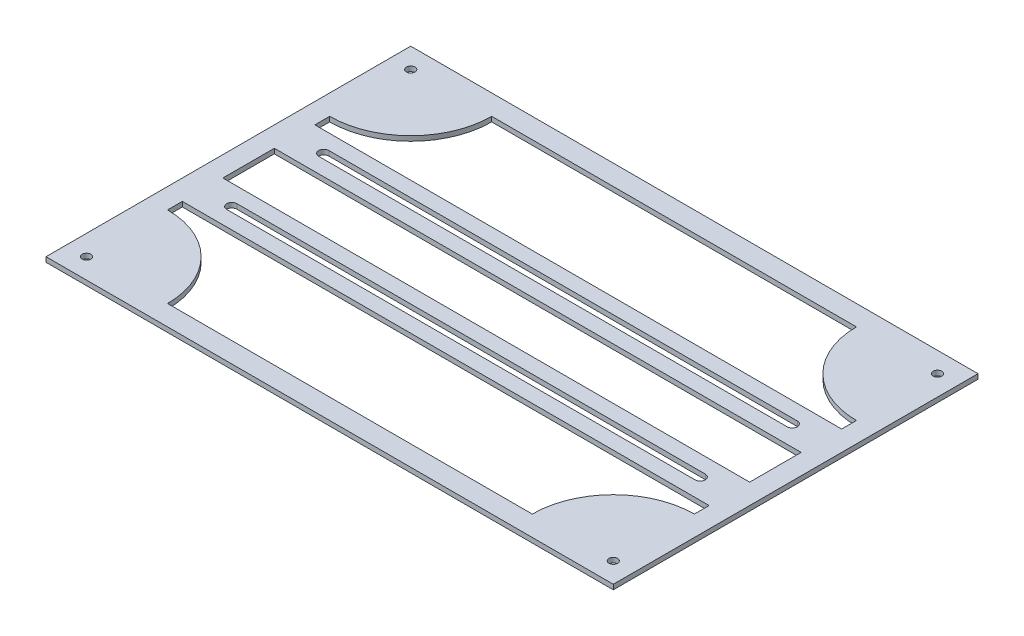
ISO-10303-21;
HEADER;
FILE_DESCRIPTION(('STEP AP214'),'2;1');
FILE_NAME('part.step','',(''),(''),'','','');
FILE_SCHEMA(('AUTOMOTIVE_DESIGN { 1 0 10303 214 1 1 1 1 }'));
ENDSEC;
DATA;
#1=APPLICATION_CONTEXT('core data for automotive mechanical design processes');
#2=APPLICATION_PROTOCOL_DEFINITION('international standard','automotive_design',2000,#1);
#3=PRODUCT_CONTEXT('',#1,'mechanical');
#4=PRODUCT('Part','Part','',(#3));
#5=PRODUCT_RELATED_PRODUCT_CATEGORY('part','',(#4));
#6=PRODUCT_DEFINITION_FORMATION('','',#4);
#7=PRODUCT_DEFINITION_CONTEXT('part definition',#1,'design');
#8=PRODUCT_DEFINITION('design','',#6,#7);
#9=PRODUCT_DEFINITION_SHAPE('','',#8);
#10=(LENGTH_UNIT() NAMED_UNIT(*) SI_UNIT(.MILLI.,.METRE.));
#11=(NAMED_UNIT(*) PLANE_ANGLE_UNIT() SI_UNIT($,.RADIAN.));
#12=(NAMED_UNIT(*) SI_UNIT($,.STERADIAN.) SOLID_ANGLE_UNIT());
#13=UNCERTAINTY_MEASURE_WITH_UNIT(LENGTH_MEASURE(1.E-05),#10,'distance_accuracy_value','');
#14=(GEOMETRIC_REPRESENTATION_CONTEXT(3) GLOBAL_UNCERTAINTY_ASSIGNED_CONTEXT((#13)) GLOBAL_UNIT_ASSIGNED_CONTEXT((#10,
#11,#12)) REPRESENTATION_CONTEXT('',''));
#15=CARTESIAN_POINT('',(0.,0.,0.));
#16=DIRECTION('',(0.,0.,1.));
#17=DIRECTION('',(1.,0.,0.));
#18=AXIS2_PLACEMENT_3D('',#15,#16,#17);
#19=CARTESIAN_POINT('',(-88.9,1.524,0.));
#20=DIRECTION('',(-1.,0.,0.));
#21=DIRECTION('',(0.,0.,1.));
#22=AXIS2_PLACEMENT_3D('',#19,#20,#21);
#23=PLANE('',#22);
#24=DIRECTION('',(0.,0.,-1.));
#25=VECTOR('',#24,1.);
#26=CARTESIAN_POINT('',(-88.9,0.,0.));
#27=LINE('',#26,#25);
#28=CARTESIAN_POINT('',(-88.9,0.,57.15));
#29=VERTEX_POINT('',#28);
#30=CARTESIAN_POINT('',(-88.9,0.,-57.15));
#31=VERTEX_POINT('',#30);
#32=EDGE_CURVE('E397',#29,#31,#27,.T.);
#33=ORIENTED_EDGE('',*,*,#32,.F.);
#34=DIRECTION('',(0.,-1.,0.));
#35=VECTOR('',#34,1.);
#36=CARTESIAN_POINT('',(-88.9,1.524,57.15));
#37=LINE('',#36,#35);
#38=CARTESIAN_POINT('',(-88.9,1.524,57.15));
#39=VERTEX_POINT('',#38);
#40=EDGE_CURVE('E11',#39,#29,#37,.T.);
#41=ORIENTED_EDGE('',*,*,#40,.F.);
#42=DIRECTION('',(0.,0.,-1.));
#43=VECTOR('',#42,1.);
#44=CARTESIAN_POINT('',(-88.9,1.524,0.));
#45=LINE('',#44,#43);
#46=CARTESIAN_POINT('',(-88.9,1.524,-57.15));
#47=VERTEX_POINT('',#46);
#48=EDGE_CURVE('E339',#39,#47,#45,.T.);
#49=ORIENTED_EDGE('',*,*,#48,.T.);
#50=DIRECTION('',(0.,-1.,0.));
#51=VECTOR('',#50,1.);
#52=CARTESIAN_POINT('',(-88.9,1.524,-57.15));
#53=LINE('',#52,#51);
#54=EDGE_CURVE('E408',#47,#31,#53,.T.);
#55=ORIENTED_EDGE('',*,*,#54,.T.);
#56=EDGE_LOOP('',(#33,#41,#49,#55));
#57=FACE_BOUND('',#56,.T.);
#58=ADVANCED_FACE('F37',(#57),#23,.T.);
#59=CARTESIAN_POINT('',(-164.548795430517,1.524,57.15));
#60=DIRECTION('',(0.,0.,1.));
#61=DIRECTION('',(1.,0.,0.));
#62=AXIS2_PLACEMENT_3D('',#59,#60,#61);
#63=PLANE('',#62);
#64=DIRECTION('',(-1.,0.,0.));
#65=VECTOR('',#64,1.);
#66=CARTESIAN_POINT('',(-164.548795430517,0.,57.15));
#67=LINE('',#66,#65);
#68=CARTESIAN_POINT('',(88.9,0.,57.15));
#69=VERTEX_POINT('',#68);
#70=EDGE_CURVE('E400',#69,#29,#67,.T.);
#71=ORIENTED_EDGE('',*,*,#70,.F.);
#72=DIRECTION('',(0.,-1.,0.));
#73=VECTOR('',#72,1.);
#74=CARTESIAN_POINT('',(88.9,1.524,57.15));
#75=LINE('',#74,#73);
#76=CARTESIAN_POINT('',(88.9,1.524,57.15));
#77=VERTEX_POINT('',#76);
#78=EDGE_CURVE('E46',#77,#69,#75,.T.);
#79=ORIENTED_EDGE('',*,*,#78,.F.);
#80=DIRECTION('',(-1.,0.,0.));
#81=VECTOR('',#80,1.);
#82=CARTESIAN_POINT('',(-164.548795430517,1.524,57.15));
#83=LINE('',#82,#81);
#84=EDGE_CURVE('E342',#77,#39,#83,.T.);
#85=ORIENTED_EDGE('',*,*,#84,.T.);
#86=ORIENTED_EDGE('',*,*,#40,.T.);
#87=EDGE_LOOP('',(#71,#79,#85,#86));
#88=FACE_BOUND('',#87,.T.);
#89=ADVANCED_FACE('F489',(#88),#63,.T.);
#90=CARTESIAN_POINT('',(88.9,1.524,0.));
#91=DIRECTION('',(-1.,0.,0.));
#92=DIRECTION('',(0.,0.,1.));
#93=AXIS2_PLACEMENT_3D('',#90,#91,#92);
#94=PLANE('',#93);
#95=DIRECTION('',(0.,0.,-1.));
#96=VECTOR('',#95,1.);
#97=CARTESIAN_POINT('',(88.9,0.,0.));
#98=LINE('',#97,#96);
#99=CARTESIAN_POINT('',(88.9,0.,-57.15));
#100=VERTEX_POINT('',#99);
#101=EDGE_CURVE('E403',#69,#100,#98,.T.);
#102=ORIENTED_EDGE('',*,*,#101,.T.);
#103=DIRECTION('',(0.,-1.,0.));
#104=VECTOR('',#103,1.);
#105=CARTESIAN_POINT('',(88.9,1.524,-57.15));
#106=LINE('',#105,#104);
#107=CARTESIAN_POINT('',(88.9,1.524,-57.15));
#108=VERTEX_POINT('',#107);
#109=EDGE_CURVE('E410',#108,#100,#106,.T.);
#110=ORIENTED_EDGE('',*,*,#109,.F.);
#111=DIRECTION('',(0.,0.,-1.));
#112=VECTOR('',#111,1.);
#113=CARTESIAN_POINT('',(88.9,1.524,0.));
#114=LINE('',#113,#112);
#115=EDGE_CURVE('E345',#77,#108,#114,.T.);
#116=ORIENTED_EDGE('',*,*,#115,.F.);
#117=ORIENTED_EDGE('',*,*,#78,.T.);
#118=EDGE_LOOP('',(#102,#110,#116,#117));
#119=FACE_BOUND('',#118,.T.);
#120=ADVANCED_FACE('F495',(#119),#94,.F.);
#121=CARTESIAN_POINT('',(82.55,1.524,0.));
#122=DIRECTION('',(-1.,0.,0.));
#123=DIRECTION('',(0.,0.,1.));
#124=AXIS2_PLACEMENT_3D('',#121,#122,#123);
#125=PLANE('',#124);
#126=DIRECTION('',(0.,0.,-1.));
#127=VECTOR('',#126,1.);
#128=CARTESIAN_POINT('',(82.55,0.,0.));
#129=LINE('',#128,#127);
#130=CARTESIAN_POINT('',(82.55,0.,8.06746468274631));
#131=VERTEX_POINT('',#130);
#132=CARTESIAN_POINT('',(82.55,0.,-8.06746468274633));
#133=VERTEX_POINT('',#132);
#134=EDGE_CURVE('E385',#131,#133,#129,.T.);
#135=ORIENTED_EDGE('',*,*,#134,.F.);
#136=DIRECTION('',(0.,-1.,0.));
#137=VECTOR('',#136,1.);
#138=CARTESIAN_POINT('',(82.55,1.524,8.06746468274631));
#139=LINE('',#138,#137);
#140=CARTESIAN_POINT('',(82.55,1.524,8.06746468274631));
#141=VERTEX_POINT('',#140);
#142=EDGE_CURVE('E411',#141,#131,#139,.T.);
#143=ORIENTED_EDGE('',*,*,#142,.F.);
#144=DIRECTION('',(0.,0.,-1.));
#145=VECTOR('',#144,1.);
#146=CARTESIAN_POINT('',(82.55,1.524,0.));
#147=LINE('',#146,#145);
#148=CARTESIAN_POINT('',(82.55,1.524,-8.06746468274633));
#149=VERTEX_POINT('',#148);
#150=EDGE_CURVE('E328',#141,#149,#147,.T.);
#151=ORIENTED_EDGE('',*,*,#150,.T.);
#152=DIRECTION('',(0.,-1.,0.));
#153=VECTOR('',#152,1.);
#154=CARTESIAN_POINT('',(82.55,1.524,-8.06746468274633));
#155=LINE('',#154,#153);
#156=EDGE_CURVE('E415',#149,#133,#155,.T.);
#157=ORIENTED_EDGE('',*,*,#156,.T.);
#158=EDGE_LOOP('',(#135,#143,#151,#157));
#159=FACE_BOUND('',#158,.T.);
#160=ADVANCED_FACE('F509',(#159),#125,.T.);
#161=CARTESIAN_POINT('',(-164.548795430517,1.524,8.06746468274631));
#162=DIRECTION('',(0.,0.,1.));
#163=DIRECTION('',(1.,0.,0.));
#164=AXIS2_PLACEMENT_3D('',#161,#162,#163);
#165=PLANE('',#164);
#166=DIRECTION('',(-1.,0.,0.));
#167=VECTOR('',#166,1.);
#168=CARTESIAN_POINT('',(-164.548795430517,0.,8.06746468274631));
#169=LINE('',#168,#167);
#170=CARTESIAN_POINT('',(-82.55,0.,8.06746468274631));
#171=VERTEX_POINT('',#170);
#172=EDGE_CURVE('E388',#131,#171,#169,.T.);
#173=ORIENTED_EDGE('',*,*,#172,.T.);
#174=DIRECTION('',(0.,-1.,0.));
#175=VECTOR('',#174,1.);
#176=CARTESIAN_POINT('',(-82.55,1.524,8.06746468274631));
#177=LINE('',#176,#175);
#178=CARTESIAN_POINT('',(-82.55,1.524,8.06746468274631));
#179=VERTEX_POINT('',#178);
#180=EDGE_CURVE('E420',#179,#171,#177,.T.);
#181=ORIENTED_EDGE('',*,*,#180,.F.);
#182=DIRECTION('',(-1.,0.,0.));
#183=VECTOR('',#182,1.);
#184=CARTESIAN_POINT('',(-164.548795430517,1.524,8.06746468274631));
#185=LINE('',#184,#183);
#186=EDGE_CURVE('E331',#141,#179,#185,.T.);
#187=ORIENTED_EDGE('',*,*,#186,.F.);
#188=ORIENTED_EDGE('',*,*,#142,.T.);
#189=EDGE_LOOP('',(#173,#181,#187,#188));
#190=FACE_BOUND('',#189,.T.);
#191=ADVANCED_FACE('F505',(#190),#165,.F.);
#192=CARTESIAN_POINT('',(-82.55,1.524,0.));
#193=DIRECTION('',(-1.,0.,0.));
#194=DIRECTION('',(0.,0.,1.));
#195=AXIS2_PLACEMENT_3D('',#192,#193,#194);
#196=PLANE('',#195);
#197=DIRECTION('',(0.,0.,-1.));
#198=VECTOR('',#197,1.);
#199=CARTESIAN_POINT('',(-82.55,0.,0.));
#200=LINE('',#199,#198);
#201=CARTESIAN_POINT('',(-82.55,0.,-8.06746468274633));
#202=VERTEX_POINT('',#201);
#203=EDGE_CURVE('E391',#171,#202,#200,.T.);
#204=ORIENTED_EDGE('',*,*,#203,.T.);
#205=DIRECTION('',(0.,-1.,0.));
#206=VECTOR('',#205,1.);
#207=CARTESIAN_POINT('',(-82.55,1.524,-8.06746468274633));
#208=LINE('',#207,#206);
#209=CARTESIAN_POINT('',(-82.55,1.524,-8.06746468274633));
#210=VERTEX_POINT('',#209);
#211=EDGE_CURVE('E417',#210,#202,#208,.T.);
#212=ORIENTED_EDGE('',*,*,#211,.F.);
#213=DIRECTION('',(0.,0.,-1.));
#214=VECTOR('',#213,1.);
#215=CARTESIAN_POINT('',(-82.55,1.524,0.));
#216=LINE('',#215,#214);
#217=EDGE_CURVE('E334',#179,#210,#216,.T.);
#218=ORIENTED_EDGE('',*,*,#217,.F.);
#219=ORIENTED_EDGE('',*,*,#180,.T.);
#220=EDGE_LOOP('',(#204,#212,#218,#219));
#221=FACE_BOUND('',#220,.T.);
#222=ADVANCED_FACE('F501',(#221),#196,.F.);
#223=CARTESIAN_POINT('',(82.55,1.524,50.8));
#224=DIRECTION('',(0.,-1.,0.));
#225=DIRECTION('',(0.,0.,-1.));
#226=AXIS2_PLACEMENT_3D('',#223,#224,#225);
#227=CYLINDRICAL_SURFACE('',#226,25.4);
#228=CARTESIAN_POINT('',(82.55,0.,50.8));
#229=DIRECTION('',(0.,1.,0.));
#230=DIRECTION('',(0.,0.,1.));
#231=AXIS2_PLACEMENT_3D('',#228,#229,#230);
#232=CIRCLE('',#231,25.4);
#233=CARTESIAN_POINT('',(57.15,0.,50.8));
#234=VERTEX_POINT('',#233);
#235=CARTESIAN_POINT('',(82.55,0.,25.3999999999999));
#236=VERTEX_POINT('',#235);
#237=EDGE_CURVE('E367',#234,#236,#232,.F.);
#238=ORIENTED_EDGE('',*,*,#237,.F.);
#239=DIRECTION('',(0.,-1.,0.));
#240=VECTOR('',#239,1.);
#241=CARTESIAN_POINT('',(57.15,1.524,50.8));
#242=LINE('',#241,#240);
#243=CARTESIAN_POINT('',(57.15,1.524,50.8));
#244=VERTEX_POINT('',#243);
#245=EDGE_CURVE('E418',#244,#234,#242,.T.);
#246=ORIENTED_EDGE('',*,*,#245,.F.);
#247=CARTESIAN_POINT('',(82.55,1.524,50.8));
#248=DIRECTION('',(0.,1.,0.));
#249=DIRECTION('',(0.,0.,1.));
#250=AXIS2_PLACEMENT_3D('',#247,#248,#249);
#251=CIRCLE('',#250,25.4);
#252=CARTESIAN_POINT('',(82.55,1.524,25.3999999999999));
#253=VERTEX_POINT('',#252);
#254=EDGE_CURVE('E311',#244,#253,#251,.F.);
#255=ORIENTED_EDGE('',*,*,#254,.T.);
#256=DIRECTION('',(0.,-1.,0.));
#257=VECTOR('',#256,1.);
#258=CARTESIAN_POINT('',(82.55,1.524,25.3999999999999));
#259=LINE('',#258,#257);
#260=EDGE_CURVE('E424',#253,#236,#259,.T.);
#261=ORIENTED_EDGE('',*,*,#260,.T.);
#262=EDGE_LOOP('',(#238,#246,#255,#261));
#263=FACE_BOUND('',#262,.T.);
#264=ADVANCED_FACE('F504',(#263),#227,.T.);
#265=CARTESIAN_POINT('',(-164.548795430517,1.524,50.8));
#266=DIRECTION('',(0.,0.,1.));
#267=DIRECTION('',(1.,0.,0.));
#268=AXIS2_PLACEMENT_3D('',#265,#266,#267);
#269=PLANE('',#268);
#270=DIRECTION('',(-1.,0.,0.));
#271=VECTOR('',#270,1.);
#272=CARTESIAN_POINT('',(-164.548795430517,0.,50.8));
#273=LINE('',#272,#271);
#274=CARTESIAN_POINT('',(-57.15,0.,50.8));
#275=VERTEX_POINT('',#274);
#276=EDGE_CURVE('E370',#234,#275,#273,.T.);
#277=ORIENTED_EDGE('',*,*,#276,.T.);
#278=DIRECTION('',(0.,-1.,0.));
#279=VECTOR('',#278,1.);
#280=CARTESIAN_POINT('',(-57.15,1.524,50.8));
#281=LINE('',#280,#279);
#282=CARTESIAN_POINT('',(-57.15,1.524,50.8));
#283=VERTEX_POINT('',#282);
#284=EDGE_CURVE('E433',#283,#275,#281,.T.);
#285=ORIENTED_EDGE('',*,*,#284,.F.);
#286=DIRECTION('',(-1.,0.,0.));
#287=VECTOR('',#286,1.);
#288=CARTESIAN_POINT('',(-164.548795430517,1.524,50.8));
#289=LINE('',#288,#287);
#290=EDGE_CURVE('E314',#244,#283,#289,.T.);
#291=ORIENTED_EDGE('',*,*,#290,.F.);
#292=ORIENTED_EDGE('',*,*,#245,.T.);
#293=EDGE_LOOP('',(#277,#285,#291,#292));
#294=FACE_BOUND('',#293,.T.);
#295=ADVANCED_FACE('F528',(#294),#269,.F.);
#296=CARTESIAN_POINT('',(-82.55,1.524,50.8));
#297=DIRECTION('',(0.,-1.,0.));
#298=DIRECTION('',(0.,0.,-1.));
#299=AXIS2_PLACEMENT_3D('',#296,#297,#298);
#300=CYLINDRICAL_SURFACE('',#299,25.4);
#301=CARTESIAN_POINT('',(-82.55,0.,50.8));
#302=DIRECTION('',(0.,1.,0.));
#303=DIRECTION('',(0.,0.,1.));
#304=AXIS2_PLACEMENT_3D('',#301,#302,#303);
#305=CIRCLE('',#304,25.4);
#306=CARTESIAN_POINT('',(-82.55,0.,25.3999999999999));
#307=VERTEX_POINT('',#306);
#308=EDGE_CURVE('E373',#275,#307,#305,.T.);
#309=ORIENTED_EDGE('',*,*,#308,.T.);
#310=DIRECTION('',(0.,-1.,0.));
#311=VECTOR('',#310,1.);
#312=CARTESIAN_POINT('',(-82.55,1.524,25.3999999999999));
#313=LINE('',#312,#311);
#314=CARTESIAN_POINT('',(-82.55,1.524,25.3999999999999));
#315=VERTEX_POINT('',#314);
#316=EDGE_CURVE('E430',#315,#307,#313,.T.);
#317=ORIENTED_EDGE('',*,*,#316,.F.);
#318=CARTESIAN_POINT('',(-82.55,1.524,50.8));
#319=DIRECTION('',(0.,1.,0.));
#320=DIRECTION('',(0.,0.,1.));
#321=AXIS2_PLACEMENT_3D('',#318,#319,#320);
#322=CIRCLE('',#321,25.4);
#323=EDGE_CURVE('E317',#283,#315,#322,.T.);
#324=ORIENTED_EDGE('',*,*,#323,.F.);
#325=ORIENTED_EDGE('',*,*,#284,.T.);
#326=EDGE_LOOP('',(#309,#317,#324,#325));
#327=FACE_BOUND('',#326,.T.);
#328=ADVANCED_FACE('F524',(#327),#300,.T.);
#329=CARTESIAN_POINT('',(-82.5500000000001,1.524,-2.39186672080716E-13));
#330=DIRECTION('',(-1.,0.,0.));
#331=DIRECTION('',(0.,0.,1.));
#332=AXIS2_PLACEMENT_3D('',#329,#330,#331);
#333=PLANE('',#332);
#334=DIRECTION('',(0.,0.,-1.));
#335=VECTOR('',#334,1.);
#336=CARTESIAN_POINT('',(-82.5500000000001,0.,-2.39186672080716E-13));
#337=LINE('',#336,#335);
#338=CARTESIAN_POINT('',(-82.55,0.,20.7674646827463));
#339=VERTEX_POINT('',#338);
#340=EDGE_CURVE('E376',#307,#339,#337,.T.);
#341=ORIENTED_EDGE('',*,*,#340,.T.);
#342=DIRECTION('',(0.,-1.,0.));
#343=VECTOR('',#342,1.);
#344=CARTESIAN_POINT('',(-82.55,1.524,20.7674646827463));
#345=LINE('',#344,#343);
#346=CARTESIAN_POINT('',(-82.55,1.524,20.7674646827463));
#347=VERTEX_POINT('',#346);
#348=EDGE_CURVE('E428',#347,#339,#345,.T.);
#349=ORIENTED_EDGE('',*,*,#348,.F.);
#350=DIRECTION('',(0.,0.,-1.));
#351=VECTOR('',#350,1.);
#352=CARTESIAN_POINT('',(-82.5500000000001,1.524,-2.39186672080716E-13));
#353=LINE('',#352,#351);
#354=EDGE_CURVE('E320',#315,#347,#353,.T.);
#355=ORIENTED_EDGE('',*,*,#354,.F.);
#356=ORIENTED_EDGE('',*,*,#316,.T.);
#357=EDGE_LOOP('',(#341,#349,#355,#356));
#358=FACE_BOUND('',#357,.T.);
#359=ADVANCED_FACE('F520',(#358),#333,.F.);
#360=CARTESIAN_POINT('',(-164.548795430517,1.524,20.7674646827463));
#361=DIRECTION('',(0.,0.,1.));
#362=DIRECTION('',(1.,0.,0.));
#363=AXIS2_PLACEMENT_3D('',#360,#361,#362);
#364=PLANE('',#363);
#365=DIRECTION('',(-1.,0.,0.));
#366=VECTOR('',#365,1.);
#367=CARTESIAN_POINT('',(-164.548795430517,0.,20.7674646827463));
#368=LINE('',#367,#366);
#369=CARTESIAN_POINT('',(82.55,0.,20.7674646827463));
#370=VERTEX_POINT('',#369);
#371=EDGE_CURVE('E379',#370,#339,#368,.T.);
#372=ORIENTED_EDGE('',*,*,#371,.F.);
#373=DIRECTION('',(0.,-1.,0.));
#374=VECTOR('',#373,1.);
#375=CARTESIAN_POINT('',(82.55,1.524,20.7674646827463));
#376=LINE('',#375,#374);
#377=CARTESIAN_POINT('',(82.55,1.524,20.7674646827463));
#378=VERTEX_POINT('',#377);
#379=EDGE_CURVE('E426',#378,#370,#376,.T.);
#380=ORIENTED_EDGE('',*,*,#379,.F.);
#381=DIRECTION('',(-1.,0.,0.));
#382=VECTOR('',#381,1.);
#383=CARTESIAN_POINT('',(-164.548795430517,1.524,20.7674646827463));
#384=LINE('',#383,#382);
#385=EDGE_CURVE('E322',#378,#347,#384,.T.);
#386=ORIENTED_EDGE('',*,*,#385,.T.);
#387=ORIENTED_EDGE('',*,*,#348,.T.);
#388=EDGE_LOOP('',(#372,#380,#386,#387));
#389=FACE_BOUND('',#388,.T.);
#390=ADVANCED_FACE('F517',(#389),#364,.T.);
#391=CARTESIAN_POINT('',(-82.55,1.524,-50.8));
#392=DIRECTION('',(0.,-1.,0.));
#393=DIRECTION('',(0.,0.,-1.));
#394=AXIS2_PLACEMENT_3D('',#391,#392,#393);
#395=CYLINDRICAL_SURFACE('',#394,25.4);
#396=CARTESIAN_POINT('',(-82.55,0.,-50.8));
#397=DIRECTION('',(0.,1.,0.));
#398=DIRECTION('',(0.,0.,1.));
#399=AXIS2_PLACEMENT_3D('',#396,#397,#398);
#400=CIRCLE('',#399,25.4);
#401=CARTESIAN_POINT('',(-57.15,0.,-50.8));
#402=VERTEX_POINT('',#401);
#403=CARTESIAN_POINT('',(-82.55,0.,-25.4));
#404=VERTEX_POINT('',#403);
#405=EDGE_CURVE('E288',#402,#404,#400,.F.);
#406=ORIENTED_EDGE('',*,*,#405,.F.);
#407=DIRECTION('',(0.,-1.,0.));
#408=VECTOR('',#407,1.);
#409=CARTESIAN_POINT('',(-57.15,1.524,-50.8));
#410=LINE('',#409,#408);
#411=CARTESIAN_POINT('',(-57.15,1.524,-50.8));
#412=VERTEX_POINT('',#411);
#413=EDGE_CURVE('E41',#412,#402,#410,.T.);
#414=ORIENTED_EDGE('',*,*,#413,.F.);
#415=CARTESIAN_POINT('',(-82.55,1.524,-50.8));
#416=DIRECTION('',(0.,1.,0.));
#417=DIRECTION('',(0.,0.,1.));
#418=AXIS2_PLACEMENT_3D('',#415,#416,#417);
#419=CIRCLE('',#418,25.4);
#420=CARTESIAN_POINT('',(-82.55,1.524,-25.4));
#421=VERTEX_POINT('',#420);
#422=EDGE_CURVE('E295',#412,#421,#419,.F.);
#423=ORIENTED_EDGE('',*,*,#422,.T.);
#424=DIRECTION('',(0.,-1.,0.));
#425=VECTOR('',#424,1.);
#426=CARTESIAN_POINT('',(-82.55,1.524,-25.4));
#427=LINE('',#426,#425);
#428=EDGE_CURVE('E350',#421,#404,#427,.T.);
#429=ORIENTED_EDGE('',*,*,#428,.T.);
#430=EDGE_LOOP('',(#406,#414,#423,#429));
#431=FACE_BOUND('',#430,.T.);
#432=ADVANCED_FACE('F39',(#431),#395,.T.);
#433=CARTESIAN_POINT('',(-164.548795430517,1.524,-50.8));
#434=DIRECTION('',(0.,0.,1.));
#435=DIRECTION('',(1.,0.,0.));
#436=AXIS2_PLACEMENT_3D('',#433,#434,#435);
#437=PLANE('',#436);
#438=DIRECTION('',(-1.,0.,0.));
#439=VECTOR('',#438,1.);
#440=CARTESIAN_POINT('',(-164.548795430517,0.,-50.8));
#441=LINE('',#440,#439);
#442=CARTESIAN_POINT('',(57.15,0.,-50.8));
#443=VERTEX_POINT('',#442);
#444=EDGE_CURVE('E353',#443,#402,#441,.T.);
#445=ORIENTED_EDGE('',*,*,#444,.F.);
#446=DIRECTION('',(0.,-1.,0.));
#447=VECTOR('',#446,1.);
#448=CARTESIAN_POINT('',(57.15,1.524,-50.8));
#449=LINE('',#448,#447);
#450=CARTESIAN_POINT('',(57.15,1.524,-50.8));
#451=VERTEX_POINT('',#450);
#452=EDGE_CURVE('E444',#451,#443,#449,.T.);
#453=ORIENTED_EDGE('',*,*,#452,.F.);
#454=DIRECTION('',(-1.,0.,0.));
#455=VECTOR('',#454,1.);
#456=CARTESIAN_POINT('',(-164.548795430517,1.524,-50.8));
#457=LINE('',#456,#455);
#458=EDGE_CURVE('E298',#451,#412,#457,.T.);
#459=ORIENTED_EDGE('',*,*,#458,.T.);
#460=ORIENTED_EDGE('',*,*,#413,.T.);
#461=EDGE_LOOP('',(#445,#453,#459,#460));
#462=FACE_BOUND('',#461,.T.);
#463=ADVANCED_FACE('F451',(#462),#437,.T.);
#464=CARTESIAN_POINT('',(82.55,1.524,-50.8));
#465=DIRECTION('',(0.,-1.,0.));
#466=DIRECTION('',(0.,0.,-1.));
#467=AXIS2_PLACEMENT_3D('',#464,#465,#466);
#468=CYLINDRICAL_SURFACE('',#467,25.4);
#469=CARTESIAN_POINT('',(82.55,0.,-50.8));
#470=DIRECTION('',(0.,1.,0.));
#471=DIRECTION('',(0.,0.,1.));
#472=AXIS2_PLACEMENT_3D('',#469,#470,#471);
#473=CIRCLE('',#472,25.4);
#474=CARTESIAN_POINT('',(82.55,0.,-25.4));
#475=VERTEX_POINT('',#474);
#476=EDGE_CURVE('E356',#443,#475,#473,.T.);
#477=ORIENTED_EDGE('',*,*,#476,.T.);
#478=DIRECTION('',(0.,-1.,0.));
#479=VECTOR('',#478,1.);
#480=CARTESIAN_POINT('',(82.55,1.524,-25.4));
#481=LINE('',#480,#479);
#482=CARTESIAN_POINT('',(82.55,1.524,-25.4));
#483=VERTEX_POINT('',#482);
#484=EDGE_CURVE('E443',#483,#475,#481,.T.);
#485=ORIENTED_EDGE('',*,*,#484,.F.);
#486=CARTESIAN_POINT('',(82.55,1.524,-50.8));
#487=DIRECTION('',(0.,1.,0.));
#488=DIRECTION('',(0.,0.,1.));
#489=AXIS2_PLACEMENT_3D('',#486,#487,#488);
#490=CIRCLE('',#489,25.4);
#491=EDGE_CURVE('E302',#451,#483,#490,.T.);
#492=ORIENTED_EDGE('',*,*,#491,.F.);
#493=ORIENTED_EDGE('',*,*,#452,.T.);
#494=EDGE_LOOP('',(#477,#485,#492,#493));
#495=FACE_BOUND('',#494,.T.);
#496=ADVANCED_FACE('F462',(#495),#468,.T.);
#497=CARTESIAN_POINT('',(82.55,1.524,-7.33780368654733E-13));
#498=DIRECTION('',(-1.,0.,0.));
#499=DIRECTION('',(0.,0.,1.));
#500=AXIS2_PLACEMENT_3D('',#497,#498,#499);
#501=PLANE('',#500);
#502=DIRECTION('',(0.,0.,-1.));
#503=VECTOR('',#502,1.);
#504=CARTESIAN_POINT('',(82.55,0.,-7.33780368654733E-13));
#505=LINE('',#504,#503);
#506=CARTESIAN_POINT('',(82.55,0.,-20.7674646827463));
#507=VERTEX_POINT('',#506);
#508=EDGE_CURVE('E359',#507,#475,#505,.T.);
#509=ORIENTED_EDGE('',*,*,#508,.F.);
#510=DIRECTION('',(0.,-1.,0.));
#511=VECTOR('',#510,1.);
#512=CARTESIAN_POINT('',(82.55,1.524,-20.7674646827463));
#513=LINE('',#512,#511);
#514=CARTESIAN_POINT('',(82.55,1.524,-20.7674646827463));
#515=VERTEX_POINT('',#514);
#516=EDGE_CURVE('E441',#515,#507,#513,.T.);
#517=ORIENTED_EDGE('',*,*,#516,.F.);
#518=DIRECTION('',(0.,0.,-1.));
#519=VECTOR('',#518,1.);
#520=CARTESIAN_POINT('',(82.55,1.524,-7.33780368654733E-13));
#521=LINE('',#520,#519);
#522=EDGE_CURVE('E304',#515,#483,#521,.T.);
#523=ORIENTED_EDGE('',*,*,#522,.T.);
#524=ORIENTED_EDGE('',*,*,#484,.T.);
#525=EDGE_LOOP('',(#509,#517,#523,#524));
#526=FACE_BOUND('',#525,.T.);
#527=ADVANCED_FACE('F465',(#526),#501,.T.);
#528=CARTESIAN_POINT('',(-164.548795430517,1.524,-20.7674646827463));
#529=DIRECTION('',(0.,0.,1.));
#530=DIRECTION('',(1.,0.,0.));
#531=AXIS2_PLACEMENT_3D('',#528,#529,#530);
#532=PLANE('',#531);
#533=DIRECTION('',(-1.,0.,0.));
#534=VECTOR('',#533,1.);
#535=CARTESIAN_POINT('',(-164.548795430517,0.,-20.7674646827463));
#536=LINE('',#535,#534);
#537=CARTESIAN_POINT('',(-82.55,0.,-20.7674646827463));
#538=VERTEX_POINT('',#537);
#539=EDGE_CURVE('E362',#507,#538,#536,.T.);
#540=ORIENTED_EDGE('',*,*,#539,.T.);
#541=DIRECTION('',(0.,-1.,0.));
#542=VECTOR('',#541,1.);
#543=CARTESIAN_POINT('',(-82.55,1.524,-20.7674646827463));
#544=LINE('',#543,#542);
#545=CARTESIAN_POINT('',(-82.55,1.524,-20.7674646827463));
#546=VERTEX_POINT('',#545);
#547=EDGE_CURVE('E438',#546,#538,#544,.T.);
#548=ORIENTED_EDGE('',*,*,#547,.F.);
#549=DIRECTION('',(-1.,0.,0.));
#550=VECTOR('',#549,1.);
#551=CARTESIAN_POINT('',(-164.548795430517,1.524,-20.7674646827463));
#552=LINE('',#551,#550);
#553=EDGE_CURVE('E307',#515,#546,#552,.T.);
#554=ORIENTED_EDGE('',*,*,#553,.F.);
#555=ORIENTED_EDGE('',*,*,#516,.T.);
#556=EDGE_LOOP('',(#540,#548,#554,#555));
#557=FACE_BOUND('',#556,.T.);
#558=ADVANCED_FACE('F475',(#557),#532,.F.);
#559=CARTESIAN_POINT('',(-164.548795430517,1.524,-8.06746468274633));
#560=DIRECTION('',(0.,0.,1.));
#561=DIRECTION('',(1.,0.,0.));
#562=AXIS2_PLACEMENT_3D('',#559,#560,#561);
#563=PLANE('',#562);
#564=DIRECTION('',(-1.,0.,0.));
#565=VECTOR('',#564,1.);
#566=CARTESIAN_POINT('',(-164.548795430517,0.,-8.06746468274633));
#567=LINE('',#566,#565);
#568=EDGE_CURVE('E394',#133,#202,#567,.T.);
#569=ORIENTED_EDGE('',*,*,#568,.F.);
#570=ORIENTED_EDGE('',*,*,#156,.F.);
#571=DIRECTION('',(-1.,0.,0.));
#572=VECTOR('',#571,1.);
#573=CARTESIAN_POINT('',(-164.548795430517,1.524,-8.06746468274633));
#574=LINE('',#573,#572);
#575=EDGE_CURVE('E336',#149,#210,#574,.T.);
#576=ORIENTED_EDGE('',*,*,#575,.T.);
#577=ORIENTED_EDGE('',*,*,#211,.T.);
#578=EDGE_LOOP('',(#569,#570,#576,#577));
#579=FACE_BOUND('',#578,.T.);
#580=ADVANCED_FACE('F477',(#579),#563,.T.);
#581=CARTESIAN_POINT('',(82.5500000000001,1.524,7.46698209794281E-13));
#582=DIRECTION('',(-1.,0.,0.));
#583=DIRECTION('',(0.,0.,1.));
#584=AXIS2_PLACEMENT_3D('',#581,#582,#583);
#585=PLANE('',#584);
#586=DIRECTION('',(0.,0.,-1.));
#587=VECTOR('',#586,1.);
#588=CARTESIAN_POINT('',(82.5500000000001,0.,7.46698209794281E-13));
#589=LINE('',#588,#587);
#590=EDGE_CURVE('E382',#236,#370,#589,.T.);
#591=ORIENTED_EDGE('',*,*,#590,.F.);
#592=ORIENTED_EDGE('',*,*,#260,.F.);
#593=DIRECTION('',(0.,0.,-1.));
#594=VECTOR('',#593,1.);
#595=CARTESIAN_POINT('',(82.5500000000001,1.524,7.46698209794281E-13));
#596=LINE('',#595,#594);
#597=EDGE_CURVE('E325',#253,#378,#596,.T.);
#598=ORIENTED_EDGE('',*,*,#597,.T.);
#599=ORIENTED_EDGE('',*,*,#379,.T.);
#600=EDGE_LOOP('',(#591,#592,#598,#599));
#601=FACE_BOUND('',#600,.T.);
#602=ADVANCED_FACE('F483',(#601),#585,.T.);
#603=CARTESIAN_POINT('',(-82.5500000000001,1.524,2.52104513220263E-13));
#604=DIRECTION('',(-1.,0.,0.));
#605=DIRECTION('',(0.,0.,1.));
#606=AXIS2_PLACEMENT_3D('',#603,#604,#605);
#607=PLANE('',#606);
#608=DIRECTION('',(0.,0.,-1.));
#609=VECTOR('',#608,1.);
#610=CARTESIAN_POINT('',(-82.5500000000001,0.,2.52104513220263E-13));
#611=LINE('',#610,#609);
#612=EDGE_CURVE('E364',#538,#404,#611,.T.);
#613=ORIENTED_EDGE('',*,*,#612,.T.);
#614=ORIENTED_EDGE('',*,*,#428,.F.);
#615=DIRECTION('',(0.,0.,-1.));
#616=VECTOR('',#615,1.);
#617=CARTESIAN_POINT('',(-82.5500000000001,1.524,2.52104513220263E-13));
#618=LINE('',#617,#616);
#619=EDGE_CURVE('E309',#546,#421,#618,.T.);
#620=ORIENTED_EDGE('',*,*,#619,.F.);
#621=ORIENTED_EDGE('',*,*,#547,.T.);
#622=EDGE_LOOP('',(#613,#614,#620,#621));
#623=FACE_BOUND('',#622,.T.);
#624=ADVANCED_FACE('F473',(#623),#607,.F.);
#625=CARTESIAN_POINT('',(-164.548795430517,1.524,-57.15));
#626=DIRECTION('',(0.,0.,1.));
#627=DIRECTION('',(1.,0.,0.));
#628=AXIS2_PLACEMENT_3D('',#625,#626,#627);
#629=PLANE('',#628);
#630=DIRECTION('',(-1.,0.,0.));
#631=VECTOR('',#630,1.);
#632=CARTESIAN_POINT('',(-164.548795430517,0.,-57.15));
#633=LINE('',#632,#631);
#634=EDGE_CURVE('E299',#100,#31,#633,.T.);
#635=ORIENTED_EDGE('',*,*,#634,.T.);
#636=ORIENTED_EDGE('',*,*,#54,.F.);
#637=DIRECTION('',(-1.,0.,0.));
#638=VECTOR('',#637,1.);
#639=CARTESIAN_POINT('',(-164.548795430517,1.524,-57.15));
#640=LINE('',#639,#638);
#641=EDGE_CURVE('E348',#108,#47,#640,.T.);
#642=ORIENTED_EDGE('',*,*,#641,.F.);
#643=ORIENTED_EDGE('',*,*,#109,.T.);
#644=EDGE_LOOP('',(#635,#636,#642,#643));
#645=FACE_BOUND('',#644,.T.);
#646=ADVANCED_FACE('F536',(#645),#629,.F.);
#647=CARTESIAN_POINT('',(-164.548795430517,1.524,0.));
#648=DIRECTION('',(0.,1.,0.));
#649=DIRECTION('',(0.,0.,1.));
#650=AXIS2_PLACEMENT_3D('',#647,#648,#649);
#651=PLANE('',#650);
#652=CARTESIAN_POINT('',(-82.55,1.524,-50.8));
#653=DIRECTION('',(0.,1.,0.));
#654=DIRECTION('',(0.,0.,1.));
#655=AXIS2_PLACEMENT_3D('',#652,#653,#654);
#656=CIRCLE('',#655,1.35254999999999);
#657=CARTESIAN_POINT('',(-82.55,1.524,-49.44745));
#658=VERTEX_POINT('',#657);
#659=EDGE_CURVE('E596',#658,#658,#656,.T.);
#660=ORIENTED_EDGE('',*,*,#659,.F.);
#661=EDGE_LOOP('',(#660));
#662=FACE_BOUND('',#661,.T.);
#663=CARTESIAN_POINT('',(-82.55,1.524,50.8));
#664=DIRECTION('',(0.,1.,0.));
#665=DIRECTION('',(0.,0.,1.));
#666=AXIS2_PLACEMENT_3D('',#663,#664,#665);
#667=CIRCLE('',#666,1.35254999999999);
#668=CARTESIAN_POINT('',(-82.55,1.524,52.15255));
#669=VERTEX_POINT('',#668);
#670=EDGE_CURVE('E592',#669,#669,#667,.T.);
#671=ORIENTED_EDGE('',*,*,#670,.F.);
#672=EDGE_LOOP('',(#671));
#673=FACE_BOUND('',#672,.T.);
#674=CARTESIAN_POINT('',(82.55,1.524,50.8));
#675=DIRECTION('',(0.,1.,0.));
#676=DIRECTION('',(0.,0.,1.));
#677=AXIS2_PLACEMENT_3D('',#674,#675,#676);
#678=CIRCLE('',#677,1.35254999999999);
#679=CARTESIAN_POINT('',(82.55,1.524,52.15255));
#680=VERTEX_POINT('',#679);
#681=EDGE_CURVE('E586',#680,#680,#678,.T.);
#682=ORIENTED_EDGE('',*,*,#681,.F.);
#683=EDGE_LOOP('',(#682));
#684=FACE_BOUND('',#683,.T.);
#685=CARTESIAN_POINT('',(82.55,1.524,-50.8));
#686=DIRECTION('',(0.,1.,0.));
#687=DIRECTION('',(0.,0.,1.));
#688=AXIS2_PLACEMENT_3D('',#685,#686,#687);
#689=CIRCLE('',#688,1.35254999999999);
#690=CARTESIAN_POINT('',(82.55,1.524,-49.44745));
#691=VERTEX_POINT('',#690);
#692=EDGE_CURVE('E247',#691,#691,#689,.T.);
#693=ORIENTED_EDGE('',*,*,#692,.F.);
#694=EDGE_LOOP('',(#693));
#695=FACE_BOUND('',#694,.T.);
#696=CARTESIAN_POINT('',(-73.406,1.524,14.4174646827463));
#697=DIRECTION('',(0.,1.,0.));
#698=DIRECTION('',(0.,0.,-1.));
#699=AXIS2_PLACEMENT_3D('',#696,#697,#698);
#700=CIRCLE('',#699,1.5875);
#701=CARTESIAN_POINT('',(-73.406,1.524,12.8299646827463));
#702=VERTEX_POINT('',#701);
#703=CARTESIAN_POINT('',(-73.406,1.524,16.0049646827463));
#704=VERTEX_POINT('',#703);
#705=EDGE_CURVE('E54',#702,#704,#700,.T.);
#706=ORIENTED_EDGE('',*,*,#705,.F.);
#707=DIRECTION('',(-1.,0.,0.));
#708=VECTOR('',#707,1.);
#709=CARTESIAN_POINT('',(-73.406,1.524,12.8299646827463));
#710=LINE('',#709,#708);
#711=CARTESIAN_POINT('',(73.406,1.524,12.8299646827463));
#712=VERTEX_POINT('',#711);
#713=EDGE_CURVE('E241',#712,#702,#710,.T.);
#714=ORIENTED_EDGE('',*,*,#713,.F.);
#715=CARTESIAN_POINT('',(73.406,1.524,14.4174646827463));
#716=DIRECTION('',(0.,1.,0.));
#717=DIRECTION('',(0.,0.,-1.));
#718=AXIS2_PLACEMENT_3D('',#715,#716,#717);
#719=CIRCLE('',#718,1.5875);
#720=CARTESIAN_POINT('',(73.406,1.524,16.0049646827463));
#721=VERTEX_POINT('',#720);
#722=EDGE_CURVE('E244',#721,#712,#719,.T.);
#723=ORIENTED_EDGE('',*,*,#722,.F.);
#724=DIRECTION('',(1.,0.,0.));
#725=VECTOR('',#724,1.);
#726=CARTESIAN_POINT('',(-73.406,1.524,16.0049646827463));
#727=LINE('',#726,#725);
#728=EDGE_CURVE('E253',#704,#721,#727,.T.);
#729=ORIENTED_EDGE('',*,*,#728,.F.);
#730=EDGE_LOOP('',(#706,#714,#723,#729));
#731=FACE_BOUND('',#730,.T.);
#732=CARTESIAN_POINT('',(-73.406,1.524,-14.4174646827463));
#733=DIRECTION('',(0.,1.,0.));
#734=DIRECTION('',(0.,0.,1.));
#735=AXIS2_PLACEMENT_3D('',#732,#733,#734);
#736=CIRCLE('',#735,1.5875);
#737=CARTESIAN_POINT('',(-73.406,1.524,-16.0049646827463));
#738=VERTEX_POINT('',#737);
#739=CARTESIAN_POINT('',(-73.406,1.524,-12.8299646827463));
#740=VERTEX_POINT('',#739);
#741=EDGE_CURVE('E259',#738,#740,#736,.T.);
#742=ORIENTED_EDGE('',*,*,#741,.F.);
#743=DIRECTION('',(-1.,0.,0.));
#744=VECTOR('',#743,1.);
#745=CARTESIAN_POINT('',(-73.406,1.524,-16.0049646827463));
#746=LINE('',#745,#744);
#747=CARTESIAN_POINT('',(73.406,1.524,-16.0049646827463));
#748=VERTEX_POINT('',#747);
#749=EDGE_CURVE('E267',#748,#738,#746,.T.);
#750=ORIENTED_EDGE('',*,*,#749,.F.);
#751=CARTESIAN_POINT('',(73.406,1.524,-14.4174646827463));
#752=DIRECTION('',(0.,1.,0.));
#753=DIRECTION('',(0.,0.,1.));
#754=AXIS2_PLACEMENT_3D('',#751,#752,#753);
#755=CIRCLE('',#754,1.5875);
#756=CARTESIAN_POINT('',(73.406,1.524,-12.8299646827463));
#757=VERTEX_POINT('',#756);
#758=EDGE_CURVE('E281',#757,#748,#755,.T.);
#759=ORIENTED_EDGE('',*,*,#758,.F.);
#760=DIRECTION('',(1.,0.,0.));
#761=VECTOR('',#760,1.);
#762=CARTESIAN_POINT('',(-73.406,1.524,-12.8299646827463));
#763=LINE('',#762,#761);
#764=EDGE_CURVE('E278',#740,#757,#763,.T.);
#765=ORIENTED_EDGE('',*,*,#764,.F.);
#766=EDGE_LOOP('',(#742,#750,#759,#765));
#767=FACE_BOUND('',#766,.T.);
#768=ORIENTED_EDGE('',*,*,#422,.F.);
#769=ORIENTED_EDGE('',*,*,#458,.F.);
#770=ORIENTED_EDGE('',*,*,#491,.T.);
#771=ORIENTED_EDGE('',*,*,#522,.F.);
#772=ORIENTED_EDGE('',*,*,#553,.T.);
#773=ORIENTED_EDGE('',*,*,#619,.T.);
#774=EDGE_LOOP('',(#768,#769,#770,#771,#772,#773));
#775=FACE_BOUND('',#774,.T.);
#776=ORIENTED_EDGE('',*,*,#254,.F.);
#777=ORIENTED_EDGE('',*,*,#290,.T.);
#778=ORIENTED_EDGE('',*,*,#323,.T.);
#779=ORIENTED_EDGE('',*,*,#354,.T.);
#780=ORIENTED_EDGE('',*,*,#385,.F.);
#781=ORIENTED_EDGE('',*,*,#597,.F.);
#782=EDGE_LOOP('',(#776,#777,#778,#779,#780,#781));
#783=FACE_BOUND('',#782,.T.);
#784=ORIENTED_EDGE('',*,*,#150,.F.);
#785=ORIENTED_EDGE('',*,*,#186,.T.);
#786=ORIENTED_EDGE('',*,*,#217,.T.);
#787=ORIENTED_EDGE('',*,*,#575,.F.);
#788=EDGE_LOOP('',(#784,#785,#786,#787));
#789=FACE_BOUND('',#788,.T.);
#790=ORIENTED_EDGE('',*,*,#48,.F.);
#791=ORIENTED_EDGE('',*,*,#84,.F.);
#792=ORIENTED_EDGE('',*,*,#115,.T.);
#793=ORIENTED_EDGE('',*,*,#641,.T.);
#794=EDGE_LOOP('',(#790,#791,#792,#793));
#795=FACE_BOUND('',#794,.T.);
#796=ADVANCED_FACE('F468',(#662,#673,#684,#695,#731,#767,#775,#783,#789,#795),#651,.T.);
#797=CARTESIAN_POINT('',(-164.548795430517,0.,0.));
#798=DIRECTION('',(0.,1.,0.));
#799=DIRECTION('',(0.,0.,1.));
#800=AXIS2_PLACEMENT_3D('',#797,#798,#799);
#801=PLANE('',#800);
#802=CARTESIAN_POINT('',(-82.55,0.,-50.8));
#803=DIRECTION('',(0.,1.,0.));
#804=DIRECTION('',(0.,0.,1.));
#805=AXIS2_PLACEMENT_3D('',#802,#803,#804);
#806=CIRCLE('',#805,1.35254999999999);
#807=CARTESIAN_POINT('',(-82.55,0.,-49.44745));
#808=VERTEX_POINT('',#807);
#809=EDGE_CURVE('E573',#808,#808,#806,.T.);
#810=ORIENTED_EDGE('',*,*,#809,.T.);
#811=EDGE_LOOP('',(#810));
#812=FACE_BOUND('',#811,.T.);
#813=CARTESIAN_POINT('',(-82.55,0.,50.8));
#814=DIRECTION('',(0.,1.,0.));
#815=DIRECTION('',(0.,0.,1.));
#816=AXIS2_PLACEMENT_3D('',#813,#814,#815);
#817=CIRCLE('',#816,1.35254999999999);
#818=CARTESIAN_POINT('',(-82.55,0.,52.15255));
#819=VERTEX_POINT('',#818);
#820=EDGE_CURVE('E577',#819,#819,#817,.T.);
#821=ORIENTED_EDGE('',*,*,#820,.T.);
#822=EDGE_LOOP('',(#821));
#823=FACE_BOUND('',#822,.T.);
#824=CARTESIAN_POINT('',(82.55,0.,50.8));
#825=DIRECTION('',(0.,1.,0.));
#826=DIRECTION('',(0.,0.,1.));
#827=AXIS2_PLACEMENT_3D('',#824,#825,#826);
#828=CIRCLE('',#827,1.35254999999999);
#829=CARTESIAN_POINT('',(82.55,0.,52.15255));
#830=VERTEX_POINT('',#829);
#831=EDGE_CURVE('E581',#830,#830,#828,.T.);
#832=ORIENTED_EDGE('',*,*,#831,.T.);
#833=EDGE_LOOP('',(#832));
#834=FACE_BOUND('',#833,.T.);
#835=CARTESIAN_POINT('',(82.55,0.,-50.8));
#836=DIRECTION('',(0.,1.,0.));
#837=DIRECTION('',(0.,0.,1.));
#838=AXIS2_PLACEMENT_3D('',#835,#836,#837);
#839=CIRCLE('',#838,1.35254999999999);
#840=CARTESIAN_POINT('',(82.55,0.,-49.44745));
#841=VERTEX_POINT('',#840);
#842=EDGE_CURVE('E584',#841,#841,#839,.T.);
#843=ORIENTED_EDGE('',*,*,#842,.T.);
#844=EDGE_LOOP('',(#843));
#845=FACE_BOUND('',#844,.T.);
#846=DIRECTION('',(-1.,0.,0.));
#847=VECTOR('',#846,1.);
#848=CARTESIAN_POINT('',(-73.406,0.,12.8299646827463));
#849=LINE('',#848,#847);
#850=CARTESIAN_POINT('',(73.406,0.,12.8299646827463));
#851=VERTEX_POINT('',#850);
#852=CARTESIAN_POINT('',(-73.406,0.,12.8299646827463));
#853=VERTEX_POINT('',#852);
#854=EDGE_CURVE('E231',#851,#853,#849,.T.);
#855=ORIENTED_EDGE('',*,*,#854,.T.);
#856=CARTESIAN_POINT('',(-73.406,0.,14.4174646827463));
#857=DIRECTION('',(0.,1.,0.));
#858=DIRECTION('',(0.,0.,-1.));
#859=AXIS2_PLACEMENT_3D('',#856,#857,#858);
#860=CIRCLE('',#859,1.5875);
#861=CARTESIAN_POINT('',(-73.406,0.,16.0049646827463));
#862=VERTEX_POINT('',#861);
#863=EDGE_CURVE('E225',#853,#862,#860,.T.);
#864=ORIENTED_EDGE('',*,*,#863,.T.);
#865=DIRECTION('',(1.,0.,0.));
#866=VECTOR('',#865,1.);
#867=CARTESIAN_POINT('',(-73.406,0.,16.0049646827463));
#868=LINE('',#867,#866);
#869=CARTESIAN_POINT('',(73.406,0.,16.0049646827463));
#870=VERTEX_POINT('',#869);
#871=EDGE_CURVE('E234',#862,#870,#868,.T.);
#872=ORIENTED_EDGE('',*,*,#871,.T.);
#873=CARTESIAN_POINT('',(73.406,0.,14.4174646827463));
#874=DIRECTION('',(0.,1.,0.));
#875=DIRECTION('',(0.,0.,-1.));
#876=AXIS2_PLACEMENT_3D('',#873,#874,#875);
#877=CIRCLE('',#876,1.5875);
#878=EDGE_CURVE('E62',#870,#851,#877,.T.);
#879=ORIENTED_EDGE('',*,*,#878,.T.);
#880=EDGE_LOOP('',(#855,#864,#872,#879));
#881=FACE_BOUND('',#880,.T.);
#882=DIRECTION('',(-1.,0.,0.));
#883=VECTOR('',#882,1.);
#884=CARTESIAN_POINT('',(-73.406,0.,-16.0049646827463));
#885=LINE('',#884,#883);
#886=CARTESIAN_POINT('',(73.406,0.,-16.0049646827463));
#887=VERTEX_POINT('',#886);
#888=CARTESIAN_POINT('',(-73.406,0.,-16.0049646827463));
#889=VERTEX_POINT('',#888);
#890=EDGE_CURVE('E273',#887,#889,#885,.T.);
#891=ORIENTED_EDGE('',*,*,#890,.T.);
#892=CARTESIAN_POINT('',(-73.406,0.,-14.4174646827463));
#893=DIRECTION('',(0.,1.,0.));
#894=DIRECTION('',(0.,0.,1.));
#895=AXIS2_PLACEMENT_3D('',#892,#893,#894);
#896=CIRCLE('',#895,1.5875);
#897=CARTESIAN_POINT('',(-73.406,0.,-12.8299646827463));
#898=VERTEX_POINT('',#897);
#899=EDGE_CURVE('E263',#889,#898,#896,.T.);
#900=ORIENTED_EDGE('',*,*,#899,.T.);
#901=DIRECTION('',(1.,0.,0.));
#902=VECTOR('',#901,1.);
#903=CARTESIAN_POINT('',(-73.406,0.,-12.8299646827463));
#904=LINE('',#903,#902);
#905=CARTESIAN_POINT('',(73.406,0.,-12.8299646827463));
#906=VERTEX_POINT('',#905);
#907=EDGE_CURVE('E266',#898,#906,#904,.T.);
#908=ORIENTED_EDGE('',*,*,#907,.T.);
#909=CARTESIAN_POINT('',(73.406,0.,-14.4174646827463));
#910=DIRECTION('',(0.,1.,0.));
#911=DIRECTION('',(0.,0.,1.));
#912=AXIS2_PLACEMENT_3D('',#909,#910,#911);
#913=CIRCLE('',#912,1.5875);
#914=EDGE_CURVE('E270',#906,#887,#913,.T.);
#915=ORIENTED_EDGE('',*,*,#914,.T.);
#916=EDGE_LOOP('',(#891,#900,#908,#915));
#917=FACE_BOUND('',#916,.T.);
#918=ORIENTED_EDGE('',*,*,#405,.T.);
#919=ORIENTED_EDGE('',*,*,#612,.F.);
#920=ORIENTED_EDGE('',*,*,#539,.F.);
#921=ORIENTED_EDGE('',*,*,#508,.T.);
#922=ORIENTED_EDGE('',*,*,#476,.F.);
#923=ORIENTED_EDGE('',*,*,#444,.T.);
#924=EDGE_LOOP('',(#918,#919,#920,#921,#922,#923));
#925=FACE_BOUND('',#924,.T.);
#926=ORIENTED_EDGE('',*,*,#237,.T.);
#927=ORIENTED_EDGE('',*,*,#590,.T.);
#928=ORIENTED_EDGE('',*,*,#371,.T.);
#929=ORIENTED_EDGE('',*,*,#340,.F.);
#930=ORIENTED_EDGE('',*,*,#308,.F.);
#931=ORIENTED_EDGE('',*,*,#276,.F.);
#932=EDGE_LOOP('',(#926,#927,#928,#929,#930,#931));
#933=FACE_BOUND('',#932,.T.);
#934=ORIENTED_EDGE('',*,*,#134,.T.);
#935=ORIENTED_EDGE('',*,*,#568,.T.);
#936=ORIENTED_EDGE('',*,*,#203,.F.);
#937=ORIENTED_EDGE('',*,*,#172,.F.);
#938=EDGE_LOOP('',(#934,#935,#936,#937));
#939=FACE_BOUND('',#938,.T.);
#940=ORIENTED_EDGE('',*,*,#32,.T.);
#941=ORIENTED_EDGE('',*,*,#634,.F.);
#942=ORIENTED_EDGE('',*,*,#101,.F.);
#943=ORIENTED_EDGE('',*,*,#70,.T.);
#944=EDGE_LOOP('',(#940,#941,#942,#943));
#945=FACE_BOUND('',#944,.T.);
#946=ADVANCED_FACE('F238',(#812,#823,#834,#845,#881,#917,#925,#933,#939,#945),#801,.F.);
#947=CARTESIAN_POINT('',(-73.406,0.,-14.4174646827463));
#948=DIRECTION('',(0.,1.,0.));
#949=DIRECTION('',(0.,0.,1.));
#950=AXIS2_PLACEMENT_3D('',#947,#948,#949);
#951=CYLINDRICAL_SURFACE('',#950,1.5875);
#952=ORIENTED_EDGE('',*,*,#741,.T.);
#953=DIRECTION('',(0.,1.,0.));
#954=VECTOR('',#953,1.);
#955=CARTESIAN_POINT('',(-73.406,0.,-12.8299646827463));
#956=LINE('',#955,#954);
#957=EDGE_CURVE('E276',#898,#740,#956,.T.);
#958=ORIENTED_EDGE('',*,*,#957,.F.);
#959=ORIENTED_EDGE('',*,*,#899,.F.);
#960=DIRECTION('',(0.,1.,0.));
#961=VECTOR('',#960,1.);
#962=CARTESIAN_POINT('',(-73.406,0.,-16.0049646827463));
#963=LINE('',#962,#961);
#964=EDGE_CURVE('E286',#889,#738,#963,.T.);
#965=ORIENTED_EDGE('',*,*,#964,.T.);
#966=EDGE_LOOP('',(#952,#958,#959,#965));
#967=FACE_BOUND('',#966,.T.);
#968=ADVANCED_FACE('F562',(#967),#951,.F.);
#969=CARTESIAN_POINT('',(-73.406,0.,-16.0049646827463));
#970=DIRECTION('',(0.,0.,-1.));
#971=DIRECTION('',(-1.,0.,0.));
#972=AXIS2_PLACEMENT_3D('',#969,#970,#971);
#973=PLANE('',#972);
#974=ORIENTED_EDGE('',*,*,#749,.T.);
#975=ORIENTED_EDGE('',*,*,#964,.F.);
#976=ORIENTED_EDGE('',*,*,#890,.F.);
#977=DIRECTION('',(0.,1.,0.));
#978=VECTOR('',#977,1.);
#979=CARTESIAN_POINT('',(73.406,0.,-16.0049646827463));
#980=LINE('',#979,#978);
#981=EDGE_CURVE('E289',#887,#748,#980,.T.);
#982=ORIENTED_EDGE('',*,*,#981,.T.);
#983=EDGE_LOOP('',(#974,#975,#976,#982));
#984=FACE_BOUND('',#983,.T.);
#985=ADVANCED_FACE('F567',(#984),#973,.F.);
#986=CARTESIAN_POINT('',(73.406,0.,-14.4174646827463));
#987=DIRECTION('',(0.,1.,0.));
#988=DIRECTION('',(0.,0.,1.));
#989=AXIS2_PLACEMENT_3D('',#986,#987,#988);
#990=CYLINDRICAL_SURFACE('',#989,1.5875);
#991=ORIENTED_EDGE('',*,*,#758,.T.);
#992=ORIENTED_EDGE('',*,*,#981,.F.);
#993=ORIENTED_EDGE('',*,*,#914,.F.);
#994=DIRECTION('',(0.,1.,0.));
#995=VECTOR('',#994,1.);
#996=CARTESIAN_POINT('',(73.406,0.,-12.8299646827463));
#997=LINE('',#996,#995);
#998=EDGE_CURVE('E291',#906,#757,#997,.T.);
#999=ORIENTED_EDGE('',*,*,#998,.T.);
#1000=EDGE_LOOP('',(#991,#992,#993,#999));
#1001=FACE_BOUND('',#1000,.T.);
#1002=ADVANCED_FACE('F624',(#1001),#990,.F.);
#1003=CARTESIAN_POINT('',(-73.406,0.,-12.8299646827463));
#1004=DIRECTION('',(0.,0.,1.));
#1005=DIRECTION('',(1.,0.,0.));
#1006=AXIS2_PLACEMENT_3D('',#1003,#1004,#1005);
#1007=PLANE('',#1006);
#1008=ORIENTED_EDGE('',*,*,#764,.T.);
#1009=ORIENTED_EDGE('',*,*,#998,.F.);
#1010=ORIENTED_EDGE('',*,*,#907,.F.);
#1011=ORIENTED_EDGE('',*,*,#957,.T.);
#1012=EDGE_LOOP('',(#1008,#1009,#1010,#1011));
#1013=FACE_BOUND('',#1012,.T.);
#1014=ADVANCED_FACE('F619',(#1013),#1007,.F.);
#1015=CARTESIAN_POINT('',(-73.406,0.,14.4174646827463));
#1016=DIRECTION('',(0.,1.,0.));
#1017=DIRECTION('',(0.,0.,1.));
#1018=AXIS2_PLACEMENT_3D('',#1015,#1016,#1017);
#1019=CYLINDRICAL_SURFACE('',#1018,1.5875);
#1020=ORIENTED_EDGE('',*,*,#705,.T.);
#1021=DIRECTION('',(0.,1.,0.));
#1022=VECTOR('',#1021,1.);
#1023=CARTESIAN_POINT('',(-73.406,0.,16.0049646827463));
#1024=LINE('',#1023,#1022);
#1025=EDGE_CURVE('E221',#862,#704,#1024,.T.);
#1026=ORIENTED_EDGE('',*,*,#1025,.F.);
#1027=ORIENTED_EDGE('',*,*,#863,.F.);
#1028=DIRECTION('',(0.,1.,0.));
#1029=VECTOR('',#1028,1.);
#1030=CARTESIAN_POINT('',(-73.406,0.,12.8299646827463));
#1031=LINE('',#1030,#1029);
#1032=EDGE_CURVE('E257',#853,#702,#1031,.T.);
#1033=ORIENTED_EDGE('',*,*,#1032,.T.);
#1034=EDGE_LOOP('',(#1020,#1026,#1027,#1033));
#1035=FACE_BOUND('',#1034,.T.);
#1036=ADVANCED_FACE('F223',(#1035),#1019,.F.);
#1037=CARTESIAN_POINT('',(-73.406,0.,12.8299646827463));
#1038=DIRECTION('',(0.,0.,-1.));
#1039=DIRECTION('',(-1.,0.,0.));
#1040=AXIS2_PLACEMENT_3D('',#1037,#1038,#1039);
#1041=PLANE('',#1040);
#1042=ORIENTED_EDGE('',*,*,#713,.T.);
#1043=ORIENTED_EDGE('',*,*,#1032,.F.);
#1044=ORIENTED_EDGE('',*,*,#854,.F.);
#1045=DIRECTION('',(0.,1.,0.));
#1046=VECTOR('',#1045,1.);
#1047=CARTESIAN_POINT('',(73.406,0.,12.8299646827463));
#1048=LINE('',#1047,#1046);
#1049=EDGE_CURVE('E260',#851,#712,#1048,.T.);
#1050=ORIENTED_EDGE('',*,*,#1049,.T.);
#1051=EDGE_LOOP('',(#1042,#1043,#1044,#1050));
#1052=FACE_BOUND('',#1051,.T.);
#1053=ADVANCED_FACE('F636',(#1052),#1041,.F.);
#1054=CARTESIAN_POINT('',(73.406,0.,14.4174646827463));
#1055=DIRECTION('',(0.,1.,0.));
#1056=DIRECTION('',(0.,0.,1.));
#1057=AXIS2_PLACEMENT_3D('',#1054,#1055,#1056);
#1058=CYLINDRICAL_SURFACE('',#1057,1.5875);
#1059=ORIENTED_EDGE('',*,*,#722,.T.);
#1060=ORIENTED_EDGE('',*,*,#1049,.F.);
#1061=ORIENTED_EDGE('',*,*,#878,.F.);
#1062=DIRECTION('',(0.,1.,0.));
#1063=VECTOR('',#1062,1.);
#1064=CARTESIAN_POINT('',(73.406,0.,16.0049646827463));
#1065=LINE('',#1064,#1063);
#1066=EDGE_CURVE('E230',#870,#721,#1065,.T.);
#1067=ORIENTED_EDGE('',*,*,#1066,.T.);
#1068=EDGE_LOOP('',(#1059,#1060,#1061,#1067));
#1069=FACE_BOUND('',#1068,.T.);
#1070=ADVANCED_FACE('F640',(#1069),#1058,.F.);
#1071=CARTESIAN_POINT('',(-73.406,0.,16.0049646827463));
#1072=DIRECTION('',(0.,0.,1.));
#1073=DIRECTION('',(1.,0.,0.));
#1074=AXIS2_PLACEMENT_3D('',#1071,#1072,#1073);
#1075=PLANE('',#1074);
#1076=ORIENTED_EDGE('',*,*,#728,.T.);
#1077=ORIENTED_EDGE('',*,*,#1066,.F.);
#1078=ORIENTED_EDGE('',*,*,#871,.F.);
#1079=ORIENTED_EDGE('',*,*,#1025,.T.);
#1080=EDGE_LOOP('',(#1076,#1077,#1078,#1079));
#1081=FACE_BOUND('',#1080,.T.);
#1082=ADVANCED_FACE('F235',(#1081),#1075,.F.);
#1083=CARTESIAN_POINT('',(82.55,7.8105,-50.8));
#1084=DIRECTION('',(0.,1.,0.));
#1085=DIRECTION('',(0.,0.,1.));
#1086=AXIS2_PLACEMENT_3D('',#1083,#1084,#1085);
#1087=CYLINDRICAL_SURFACE('',#1086,1.35254999999999);
#1088=ORIENTED_EDGE('',*,*,#692,.T.);
#1089=EDGE_LOOP('',(#1088));
#1090=FACE_BOUND('',#1089,.T.);
#1091=ORIENTED_EDGE('',*,*,#842,.F.);
#1092=EDGE_LOOP('',(#1091));
#1093=FACE_BOUND('',#1092,.T.);
#1094=ADVANCED_FACE('F639',(#1090,#1093),#1087,.F.);
#1095=CARTESIAN_POINT('',(82.55,7.8105,50.8));
#1096=DIRECTION('',(0.,1.,0.));
#1097=DIRECTION('',(0.,0.,1.));
#1098=AXIS2_PLACEMENT_3D('',#1095,#1096,#1097);
#1099=CYLINDRICAL_SURFACE('',#1098,1.35254999999999);
#1100=ORIENTED_EDGE('',*,*,#681,.T.);
#1101=EDGE_LOOP('',(#1100));
#1102=FACE_BOUND('',#1101,.T.);
#1103=ORIENTED_EDGE('',*,*,#831,.F.);
#1104=EDGE_LOOP('',(#1103));
#1105=FACE_BOUND('',#1104,.T.);
#1106=ADVANCED_FACE('F648',(#1102,#1105),#1099,.F.);
#1107=CARTESIAN_POINT('',(-82.55,7.8105,50.8));
#1108=DIRECTION('',(0.,1.,0.));
#1109=DIRECTION('',(0.,0.,1.));
#1110=AXIS2_PLACEMENT_3D('',#1107,#1108,#1109);
#1111=CYLINDRICAL_SURFACE('',#1110,1.35254999999999);
#1112=ORIENTED_EDGE('',*,*,#670,.T.);
#1113=EDGE_LOOP('',(#1112));
#1114=FACE_BOUND('',#1113,.T.);
#1115=ORIENTED_EDGE('',*,*,#820,.F.);
#1116=EDGE_LOOP('',(#1115));
#1117=FACE_BOUND('',#1116,.T.);
#1118=ADVANCED_FACE('F652',(#1114,#1117),#1111,.F.);
#1119=CARTESIAN_POINT('',(-82.55,7.8105,-50.8));
#1120=DIRECTION('',(0.,1.,0.));
#1121=DIRECTION('',(0.,0.,1.));
#1122=AXIS2_PLACEMENT_3D('',#1119,#1120,#1121);
#1123=CYLINDRICAL_SURFACE('',#1122,1.35254999999999);
#1124=ORIENTED_EDGE('',*,*,#659,.T.);
#1125=EDGE_LOOP('',(#1124));
#1126=FACE_BOUND('',#1125,.T.);
#1127=ORIENTED_EDGE('',*,*,#809,.F.);
#1128=EDGE_LOOP('',(#1127));
#1129=FACE_BOUND('',#1128,.T.);
#1130=ADVANCED_FACE('F601',(#1126,#1129),#1123,.F.);
#1131=CLOSED_SHELL('',(#58,#89,#120,#160,#191,#222,#264,#295,#328,#359,#390,#432,#463,#496,#527,
#558,#580,#602,#624,#646,#796,#946,#968,#985,#1002,#1014,#1036,#1053,#1070,#1082,#1094,#1106,
#1118,#1130));
#1132=MANIFOLD_SOLID_BREP('B2',#1131);
#1133=ADVANCED_BREP_SHAPE_REPRESENTATION('',(#18,#1132),#14);
#1134=SHAPE_DEFINITION_REPRESENTATION(#9,#1133);
ENDSEC;
END-ISO-10303-21;
